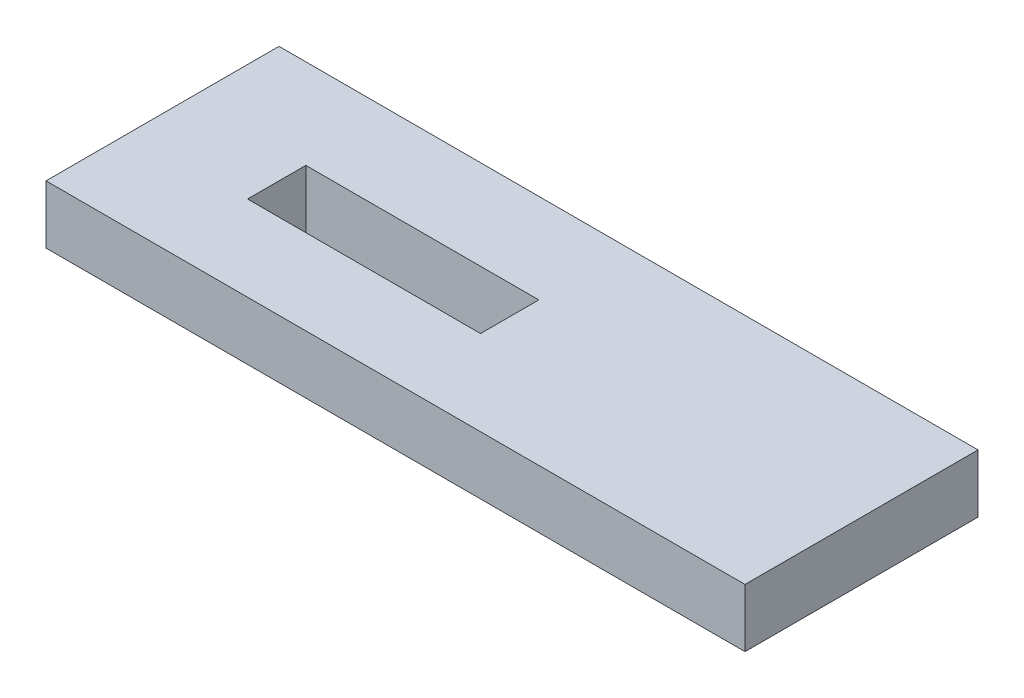
ISO-10303-21;
HEADER;
FILE_DESCRIPTION(('STEP AP214'),'2;1');
FILE_NAME('part.step','',(''),(''),'','','');
FILE_SCHEMA(('AUTOMOTIVE_DESIGN { 1 0 10303 214 1 1 1 1 }'));
ENDSEC;
DATA;
#1=APPLICATION_CONTEXT('core data for automotive mechanical design processes');
#2=APPLICATION_PROTOCOL_DEFINITION('international standard','automotive_design',2000,#1);
#3=PRODUCT_CONTEXT('',#1,'mechanical');
#4=PRODUCT('Part','Part','',(#3));
#5=PRODUCT_RELATED_PRODUCT_CATEGORY('part','',(#4));
#6=PRODUCT_DEFINITION_FORMATION('','',#4);
#7=PRODUCT_DEFINITION_CONTEXT('part definition',#1,'design');
#8=PRODUCT_DEFINITION('design','',#6,#7);
#9=PRODUCT_DEFINITION_SHAPE('','',#8);
#10=(LENGTH_UNIT() NAMED_UNIT(*) SI_UNIT(.MILLI.,.METRE.));
#11=(NAMED_UNIT(*) PLANE_ANGLE_UNIT() SI_UNIT($,.RADIAN.));
#12=(NAMED_UNIT(*) SI_UNIT($,.STERADIAN.) SOLID_ANGLE_UNIT());
#13=UNCERTAINTY_MEASURE_WITH_UNIT(LENGTH_MEASURE(1.E-05),#10,'distance_accuracy_value','');
#14=(GEOMETRIC_REPRESENTATION_CONTEXT(3) GLOBAL_UNCERTAINTY_ASSIGNED_CONTEXT((#13)) GLOBAL_UNIT_ASSIGNED_CONTEXT((#10,
#11,#12)) REPRESENTATION_CONTEXT('',''));
#15=CARTESIAN_POINT('',(0.,0.,0.));
#16=DIRECTION('',(0.,0.,1.));
#17=DIRECTION('',(1.,0.,0.));
#18=AXIS2_PLACEMENT_3D('',#15,#16,#17);
#19=CARTESIAN_POINT('',(0.,6.35,0.));
#20=DIRECTION('',(0.,-1.,0.));
#21=DIRECTION('',(0.,0.,-1.));
#22=AXIS2_PLACEMENT_3D('',#19,#20,#21);
#23=PLANE('',#22);
#24=DIRECTION('',(0.,0.,1.));
#25=VECTOR('',#24,1.);
#26=CARTESIAN_POINT('',(0.,6.35,0.));
#27=LINE('',#26,#25);
#28=CARTESIAN_POINT('',(0.,6.35,-25.4));
#29=VERTEX_POINT('',#28);
#30=CARTESIAN_POINT('',(0.,6.35,0.));
#31=VERTEX_POINT('',#30);
#32=EDGE_CURVE('E153',#29,#31,#27,.T.);
#33=ORIENTED_EDGE('',*,*,#32,.T.);
#34=DIRECTION('',(1.,0.,0.));
#35=VECTOR('',#34,1.);
#36=CARTESIAN_POINT('',(0.,6.35,0.));
#37=LINE('',#36,#35);
#38=CARTESIAN_POINT('',(76.2,6.35,0.));
#39=VERTEX_POINT('',#38);
#40=EDGE_CURVE('E157',#31,#39,#37,.T.);
#41=ORIENTED_EDGE('',*,*,#40,.T.);
#42=DIRECTION('',(0.,0.,-1.));
#43=VECTOR('',#42,1.);
#44=CARTESIAN_POINT('',(76.2,6.35,0.));
#45=LINE('',#44,#43);
#46=CARTESIAN_POINT('',(76.2,6.35,-25.4));
#47=VERTEX_POINT('',#46);
#48=EDGE_CURVE('E161',#39,#47,#45,.T.);
#49=ORIENTED_EDGE('',*,*,#48,.T.);
#50=DIRECTION('',(-1.,0.,0.));
#51=VECTOR('',#50,1.);
#52=CARTESIAN_POINT('',(0.,6.35,-25.4));
#53=LINE('',#52,#51);
#54=EDGE_CURVE('E164',#47,#29,#53,.T.);
#55=ORIENTED_EDGE('',*,*,#54,.T.);
#56=EDGE_LOOP('',(#33,#41,#49,#55));
#57=FACE_BOUND('',#56,.T.);
#58=DIRECTION('',(0.,0.,1.));
#59=VECTOR('',#58,1.);
#60=CARTESIAN_POINT('',(12.7,6.35,-15.621));
#61=LINE('',#60,#59);
#62=CARTESIAN_POINT('',(12.7,6.35,-15.621));
#63=VERTEX_POINT('',#62);
#64=CARTESIAN_POINT('',(12.7,6.35,-9.271));
#65=VERTEX_POINT('',#64);
#66=EDGE_CURVE('E105',#63,#65,#61,.T.);
#67=ORIENTED_EDGE('',*,*,#66,.F.);
#68=DIRECTION('',(-1.,0.,0.));
#69=VECTOR('',#68,1.);
#70=CARTESIAN_POINT('',(12.7,6.35,-15.621));
#71=LINE('',#70,#69);
#72=CARTESIAN_POINT('',(38.1,6.35,-15.621));
#73=VERTEX_POINT('',#72);
#74=EDGE_CURVE('E131',#73,#63,#71,.T.);
#75=ORIENTED_EDGE('',*,*,#74,.F.);
#76=DIRECTION('',(0.,0.,-1.));
#77=VECTOR('',#76,1.);
#78=CARTESIAN_POINT('',(38.1,6.35,-15.621));
#79=LINE('',#78,#77);
#80=CARTESIAN_POINT('',(38.1,6.35,-9.271));
#81=VERTEX_POINT('',#80);
#82=EDGE_CURVE('E127',#81,#73,#79,.T.);
#83=ORIENTED_EDGE('',*,*,#82,.F.);
#84=DIRECTION('',(1.,0.,0.));
#85=VECTOR('',#84,1.);
#86=CARTESIAN_POINT('',(12.7,6.35,-9.271));
#87=LINE('',#86,#85);
#88=EDGE_CURVE('E114',#65,#81,#87,.T.);
#89=ORIENTED_EDGE('',*,*,#88,.F.);
#90=EDGE_LOOP('',(#67,#75,#83,#89));
#91=FACE_BOUND('',#90,.T.);
#92=ADVANCED_FACE('F39',(#57,#91),#23,.F.);
#93=CARTESIAN_POINT('',(0.,0.,0.));
#94=DIRECTION('',(0.,-1.,0.));
#95=DIRECTION('',(0.,0.,-1.));
#96=AXIS2_PLACEMENT_3D('',#93,#94,#95);
#97=PLANE('',#96);
#98=DIRECTION('',(0.,0.,1.));
#99=VECTOR('',#98,1.);
#100=CARTESIAN_POINT('',(0.,0.,0.));
#101=LINE('',#100,#99);
#102=CARTESIAN_POINT('',(0.,0.,-25.4));
#103=VERTEX_POINT('',#102);
#104=CARTESIAN_POINT('',(0.,0.,0.));
#105=VERTEX_POINT('',#104);
#106=EDGE_CURVE('E123',#103,#105,#101,.T.);
#107=ORIENTED_EDGE('',*,*,#106,.F.);
#108=DIRECTION('',(-1.,0.,0.));
#109=VECTOR('',#108,1.);
#110=CARTESIAN_POINT('',(0.,0.,-25.4));
#111=LINE('',#110,#109);
#112=CARTESIAN_POINT('',(76.2,0.,-25.4));
#113=VERTEX_POINT('',#112);
#114=EDGE_CURVE('E158',#113,#103,#111,.T.);
#115=ORIENTED_EDGE('',*,*,#114,.F.);
#116=DIRECTION('',(0.,0.,-1.));
#117=VECTOR('',#116,1.);
#118=CARTESIAN_POINT('',(76.2,0.,0.));
#119=LINE('',#118,#117);
#120=CARTESIAN_POINT('',(76.2,0.,0.));
#121=VERTEX_POINT('',#120);
#122=EDGE_CURVE('E174',#121,#113,#119,.T.);
#123=ORIENTED_EDGE('',*,*,#122,.F.);
#124=DIRECTION('',(1.,0.,0.));
#125=VECTOR('',#124,1.);
#126=CARTESIAN_POINT('',(0.,0.,0.));
#127=LINE('',#126,#125);
#128=EDGE_CURVE('E171',#105,#121,#127,.T.);
#129=ORIENTED_EDGE('',*,*,#128,.F.);
#130=EDGE_LOOP('',(#107,#115,#123,#129));
#131=FACE_BOUND('',#130,.T.);
#132=DIRECTION('',(-1.,0.,0.));
#133=VECTOR('',#132,1.);
#134=CARTESIAN_POINT('',(12.7,0.,-15.621));
#135=LINE('',#134,#133);
#136=CARTESIAN_POINT('',(38.1,0.,-15.621));
#137=VERTEX_POINT('',#136);
#138=CARTESIAN_POINT('',(12.7,0.,-15.621));
#139=VERTEX_POINT('',#138);
#140=EDGE_CURVE('E115',#137,#139,#135,.T.);
#141=ORIENTED_EDGE('',*,*,#140,.T.);
#142=DIRECTION('',(0.,0.,1.));
#143=VECTOR('',#142,1.);
#144=CARTESIAN_POINT('',(12.7,0.,-15.621));
#145=LINE('',#144,#143);
#146=CARTESIAN_POINT('',(12.7,0.,-9.271));
#147=VERTEX_POINT('',#146);
#148=EDGE_CURVE('E63',#139,#147,#145,.T.);
#149=ORIENTED_EDGE('',*,*,#148,.T.);
#150=DIRECTION('',(1.,0.,0.));
#151=VECTOR('',#150,1.);
#152=CARTESIAN_POINT('',(12.7,0.,-9.271));
#153=LINE('',#152,#151);
#154=CARTESIAN_POINT('',(38.1,0.,-9.271));
#155=VERTEX_POINT('',#154);
#156=EDGE_CURVE('E121',#147,#155,#153,.T.);
#157=ORIENTED_EDGE('',*,*,#156,.T.);
#158=DIRECTION('',(0.,0.,-1.));
#159=VECTOR('',#158,1.);
#160=CARTESIAN_POINT('',(38.1,0.,-15.621));
#161=LINE('',#160,#159);
#162=EDGE_CURVE('E140',#155,#137,#161,.T.);
#163=ORIENTED_EDGE('',*,*,#162,.T.);
#164=EDGE_LOOP('',(#141,#149,#157,#163));
#165=FACE_BOUND('',#164,.T.);
#166=ADVANCED_FACE('F197',(#131,#165),#97,.T.);
#167=CARTESIAN_POINT('',(0.,6.35,0.));
#168=DIRECTION('',(1.,0.,0.));
#169=DIRECTION('',(0.,0.,-1.));
#170=AXIS2_PLACEMENT_3D('',#167,#168,#169);
#171=PLANE('',#170);
#172=ORIENTED_EDGE('',*,*,#106,.T.);
#173=DIRECTION('',(0.,-1.,0.));
#174=VECTOR('',#173,1.);
#175=CARTESIAN_POINT('',(0.,6.35,0.));
#176=LINE('',#175,#174);
#177=EDGE_CURVE('E11',#31,#105,#176,.T.);
#178=ORIENTED_EDGE('',*,*,#177,.F.);
#179=ORIENTED_EDGE('',*,*,#32,.F.);
#180=DIRECTION('',(0.,-1.,0.));
#181=VECTOR('',#180,1.);
#182=CARTESIAN_POINT('',(0.,6.35,-25.4));
#183=LINE('',#182,#181);
#184=EDGE_CURVE('E167',#29,#103,#183,.T.);
#185=ORIENTED_EDGE('',*,*,#184,.T.);
#186=EDGE_LOOP('',(#172,#178,#179,#185));
#187=FACE_BOUND('',#186,.T.);
#188=ADVANCED_FACE('F41',(#187),#171,.F.);
#189=CARTESIAN_POINT('',(0.,6.35,0.));
#190=DIRECTION('',(0.,0.,-1.));
#191=DIRECTION('',(-1.,0.,0.));
#192=AXIS2_PLACEMENT_3D('',#189,#190,#191);
#193=PLANE('',#192);
#194=ORIENTED_EDGE('',*,*,#128,.T.);
#195=DIRECTION('',(0.,-1.,0.));
#196=VECTOR('',#195,1.);
#197=CARTESIAN_POINT('',(76.2,6.35,0.));
#198=LINE('',#197,#196);
#199=EDGE_CURVE('E48',#39,#121,#198,.T.);
#200=ORIENTED_EDGE('',*,*,#199,.F.);
#201=ORIENTED_EDGE('',*,*,#40,.F.);
#202=ORIENTED_EDGE('',*,*,#177,.T.);
#203=EDGE_LOOP('',(#194,#200,#201,#202));
#204=FACE_BOUND('',#203,.T.);
#205=ADVANCED_FACE('F207',(#204),#193,.F.);
#206=CARTESIAN_POINT('',(76.2,6.35,0.));
#207=DIRECTION('',(-1.,0.,0.));
#208=DIRECTION('',(0.,0.,1.));
#209=AXIS2_PLACEMENT_3D('',#206,#207,#208);
#210=PLANE('',#209);
#211=ORIENTED_EDGE('',*,*,#122,.T.);
#212=DIRECTION('',(0.,-1.,0.));
#213=VECTOR('',#212,1.);
#214=CARTESIAN_POINT('',(76.2,6.35,-25.4));
#215=LINE('',#214,#213);
#216=EDGE_CURVE('E182',#47,#113,#215,.T.);
#217=ORIENTED_EDGE('',*,*,#216,.F.);
#218=ORIENTED_EDGE('',*,*,#48,.F.);
#219=ORIENTED_EDGE('',*,*,#199,.T.);
#220=EDGE_LOOP('',(#211,#217,#218,#219));
#221=FACE_BOUND('',#220,.T.);
#222=ADVANCED_FACE('F191',(#221),#210,.F.);
#223=CARTESIAN_POINT('',(0.,6.35,-25.4));
#224=DIRECTION('',(0.,0.,1.));
#225=DIRECTION('',(1.,0.,0.));
#226=AXIS2_PLACEMENT_3D('',#223,#224,#225);
#227=PLANE('',#226);
#228=ORIENTED_EDGE('',*,*,#114,.T.);
#229=ORIENTED_EDGE('',*,*,#184,.F.);
#230=ORIENTED_EDGE('',*,*,#54,.F.);
#231=ORIENTED_EDGE('',*,*,#216,.T.);
#232=EDGE_LOOP('',(#228,#229,#230,#231));
#233=FACE_BOUND('',#232,.T.);
#234=ADVANCED_FACE('F201',(#233),#227,.F.);
#235=CARTESIAN_POINT('',(12.7,6.35,-15.621));
#236=DIRECTION('',(1.,0.,0.));
#237=DIRECTION('',(0.,0.,-1.));
#238=AXIS2_PLACEMENT_3D('',#235,#236,#237);
#239=PLANE('',#238);
#240=ORIENTED_EDGE('',*,*,#148,.F.);
#241=DIRECTION('',(0.,-1.,0.));
#242=VECTOR('',#241,1.);
#243=CARTESIAN_POINT('',(12.7,6.35,-15.621));
#244=LINE('',#243,#242);
#245=EDGE_CURVE('E109',#63,#139,#244,.T.);
#246=ORIENTED_EDGE('',*,*,#245,.F.);
#247=ORIENTED_EDGE('',*,*,#66,.T.);
#248=DIRECTION('',(0.,-1.,0.));
#249=VECTOR('',#248,1.);
#250=CARTESIAN_POINT('',(12.7,6.35,-9.271));
#251=LINE('',#250,#249);
#252=EDGE_CURVE('E108',#65,#147,#251,.T.);
#253=ORIENTED_EDGE('',*,*,#252,.T.);
#254=EDGE_LOOP('',(#240,#246,#247,#253));
#255=FACE_BOUND('',#254,.T.);
#256=ADVANCED_FACE('F107',(#255),#239,.T.);
#257=CARTESIAN_POINT('',(12.7,6.35,-9.271));
#258=DIRECTION('',(0.,0.,-1.));
#259=DIRECTION('',(-1.,0.,0.));
#260=AXIS2_PLACEMENT_3D('',#257,#258,#259);
#261=PLANE('',#260);
#262=ORIENTED_EDGE('',*,*,#156,.F.);
#263=ORIENTED_EDGE('',*,*,#252,.F.);
#264=ORIENTED_EDGE('',*,*,#88,.T.);
#265=DIRECTION('',(0.,-1.,0.));
#266=VECTOR('',#265,1.);
#267=CARTESIAN_POINT('',(38.1,6.35,-9.271));
#268=LINE('',#267,#266);
#269=EDGE_CURVE('E124',#81,#155,#268,.T.);
#270=ORIENTED_EDGE('',*,*,#269,.T.);
#271=EDGE_LOOP('',(#262,#263,#264,#270));
#272=FACE_BOUND('',#271,.T.);
#273=ADVANCED_FACE('F118',(#272),#261,.T.);
#274=CARTESIAN_POINT('',(38.1,6.35,-15.621));
#275=DIRECTION('',(-1.,0.,0.));
#276=DIRECTION('',(0.,0.,1.));
#277=AXIS2_PLACEMENT_3D('',#274,#275,#276);
#278=PLANE('',#277);
#279=ORIENTED_EDGE('',*,*,#162,.F.);
#280=ORIENTED_EDGE('',*,*,#269,.F.);
#281=ORIENTED_EDGE('',*,*,#82,.T.);
#282=DIRECTION('',(0.,-1.,0.));
#283=VECTOR('',#282,1.);
#284=CARTESIAN_POINT('',(38.1,6.35,-15.621));
#285=LINE('',#284,#283);
#286=EDGE_CURVE('E55',#73,#137,#285,.T.);
#287=ORIENTED_EDGE('',*,*,#286,.T.);
#288=EDGE_LOOP('',(#279,#280,#281,#287));
#289=FACE_BOUND('',#288,.T.);
#290=ADVANCED_FACE('F230',(#289),#278,.T.);
#291=CARTESIAN_POINT('',(12.7,6.35,-15.621));
#292=DIRECTION('',(0.,0.,1.));
#293=DIRECTION('',(1.,0.,0.));
#294=AXIS2_PLACEMENT_3D('',#291,#292,#293);
#295=PLANE('',#294);
#296=ORIENTED_EDGE('',*,*,#140,.F.);
#297=ORIENTED_EDGE('',*,*,#286,.F.);
#298=ORIENTED_EDGE('',*,*,#74,.T.);
#299=ORIENTED_EDGE('',*,*,#245,.T.);
#300=EDGE_LOOP('',(#296,#297,#298,#299));
#301=FACE_BOUND('',#300,.T.);
#302=ADVANCED_FACE('F234',(#301),#295,.T.);
#303=CLOSED_SHELL('',(#92,#166,#188,#205,#222,#234,#256,#273,#290,#302));
#304=MANIFOLD_SOLID_BREP('B2',#303);
#305=ADVANCED_BREP_SHAPE_REPRESENTATION('',(#18,#304),#14);
#306=SHAPE_DEFINITION_REPRESENTATION(#9,#305);
ENDSEC;
END-ISO-10303-21;
